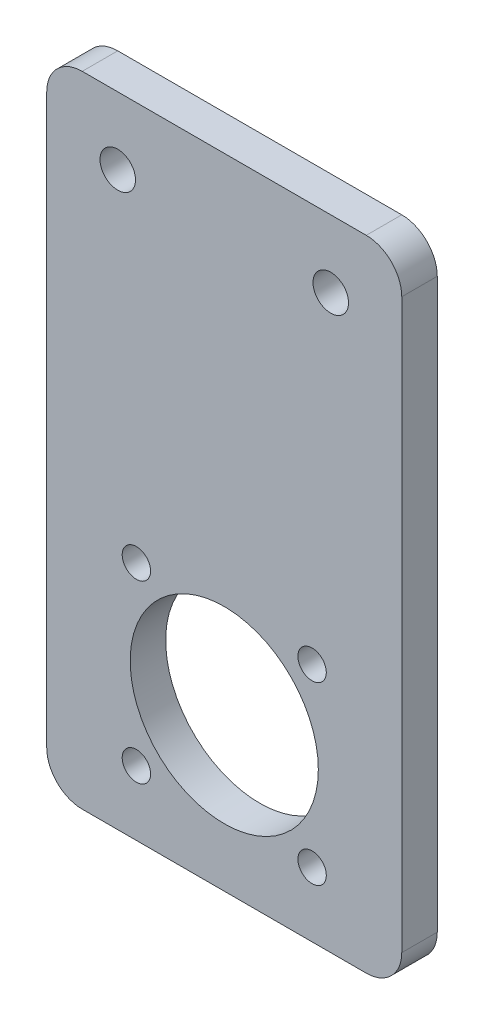
ISO-10303-21;
HEADER;
FILE_DESCRIPTION(('STEP AP214'),'2;1');
FILE_NAME('part.step','',(''),(''),'','','');
FILE_SCHEMA(('AUTOMOTIVE_DESIGN { 1 0 10303 214 1 1 1 1 }'));
ENDSEC;
DATA;
#1=APPLICATION_CONTEXT('core data for automotive mechanical design processes');
#2=APPLICATION_PROTOCOL_DEFINITION('international standard','automotive_design',2000,#1);
#3=PRODUCT_CONTEXT('',#1,'mechanical');
#4=PRODUCT('Part','Part','',(#3));
#5=PRODUCT_RELATED_PRODUCT_CATEGORY('part','',(#4));
#6=PRODUCT_DEFINITION_FORMATION('','',#4);
#7=PRODUCT_DEFINITION_CONTEXT('part definition',#1,'design');
#8=PRODUCT_DEFINITION('design','',#6,#7);
#9=PRODUCT_DEFINITION_SHAPE('','',#8);
#10=(LENGTH_UNIT() NAMED_UNIT(*) SI_UNIT(.MILLI.,.METRE.));
#11=(NAMED_UNIT(*) PLANE_ANGLE_UNIT() SI_UNIT($,.RADIAN.));
#12=(NAMED_UNIT(*) SI_UNIT($,.STERADIAN.) SOLID_ANGLE_UNIT());
#13=UNCERTAINTY_MEASURE_WITH_UNIT(LENGTH_MEASURE(1.E-05),#10,'distance_accuracy_value','');
#14=(GEOMETRIC_REPRESENTATION_CONTEXT(3) GLOBAL_UNCERTAINTY_ASSIGNED_CONTEXT((#13)) GLOBAL_UNIT_ASSIGNED_CONTEXT((#10,
#11,#12)) REPRESENTATION_CONTEXT('',''));
#15=CARTESIAN_POINT('',(0.,0.,0.));
#16=DIRECTION('',(0.,0.,1.));
#17=DIRECTION('',(1.,0.,0.));
#18=AXIS2_PLACEMENT_3D('',#15,#16,#17);
#19=CARTESIAN_POINT('',(0.,0.,5.));
#20=DIRECTION('',(0.,0.,1.));
#21=DIRECTION('',(1.,0.,0.));
#22=AXIS2_PLACEMENT_3D('',#19,#20,#21);
#23=PLANE('',#22);
#24=CARTESIAN_POINT('',(12.6256313292355,-80.8993686707646,5.));
#25=DIRECTION('',(0.,0.,1.));
#26=DIRECTION('',(1.,0.,0.));
#27=AXIS2_PLACEMENT_3D('',#24,#25,#26);
#28=CIRCLE('',#27,2.00000000000001);
#29=CARTESIAN_POINT('',(14.6256313292355,-80.8993686707646,5.));
#30=VERTEX_POINT('',#29);
#31=EDGE_CURVE('E249',#30,#30,#28,.T.);
#32=ORIENTED_EDGE('',*,*,#31,.F.);
#33=EDGE_LOOP('',(#32));
#34=FACE_BOUND('',#33,.T.);
#35=CARTESIAN_POINT('',(25.,-68.525,5.));
#36=DIRECTION('',(0.,0.,1.));
#37=DIRECTION('',(1.,0.,0.));
#38=AXIS2_PLACEMENT_3D('',#35,#36,#37);
#39=CIRCLE('',#38,13.25);
#40=CARTESIAN_POINT('',(38.25,-68.525,5.));
#41=VERTEX_POINT('',#40);
#42=EDGE_CURVE('E233',#41,#41,#39,.T.);
#43=ORIENTED_EDGE('',*,*,#42,.F.);
#44=EDGE_LOOP('',(#43));
#45=FACE_BOUND('',#44,.T.);
#46=CARTESIAN_POINT('',(40.,-9.5,5.));
#47=DIRECTION('',(0.,0.,1.));
#48=DIRECTION('',(1.,0.,0.));
#49=AXIS2_PLACEMENT_3D('',#46,#47,#48);
#50=CIRCLE('',#49,2.5);
#51=CARTESIAN_POINT('',(42.5,-9.5,5.));
#52=VERTEX_POINT('',#51);
#53=EDGE_CURVE('E219',#52,#52,#50,.T.);
#54=ORIENTED_EDGE('',*,*,#53,.F.);
#55=EDGE_LOOP('',(#54));
#56=FACE_BOUND('',#55,.T.);
#57=DIRECTION('',(1.,0.,0.));
#58=VECTOR('',#57,1.);
#59=CARTESIAN_POINT('',(0.,-90.,5.));
#60=LINE('',#59,#58);
#61=CARTESIAN_POINT('',(5.00000000000001,-90.,5.));
#62=VERTEX_POINT('',#61);
#63=CARTESIAN_POINT('',(45.,-90.,5.));
#64=VERTEX_POINT('',#63);
#65=EDGE_CURVE('E199',#62,#64,#60,.T.);
#66=ORIENTED_EDGE('',*,*,#65,.T.);
#67=CARTESIAN_POINT('',(45.,-85.,5.));
#68=DIRECTION('',(0.,0.,1.));
#69=DIRECTION('',(1.,0.,0.));
#70=AXIS2_PLACEMENT_3D('',#67,#68,#69);
#71=CIRCLE('',#70,5.);
#72=CARTESIAN_POINT('',(50.,-85.,5.));
#73=VERTEX_POINT('',#72);
#74=EDGE_CURVE('E172',#64,#73,#71,.T.);
#75=ORIENTED_EDGE('',*,*,#74,.T.);
#76=DIRECTION('',(0.,1.,0.));
#77=VECTOR('',#76,1.);
#78=CARTESIAN_POINT('',(50.,0.,5.));
#79=LINE('',#78,#77);
#80=CARTESIAN_POINT('',(50.,-5.,5.));
#81=VERTEX_POINT('',#80);
#82=EDGE_CURVE('E129',#73,#81,#79,.T.);
#83=ORIENTED_EDGE('',*,*,#82,.T.);
#84=CARTESIAN_POINT('',(45.,-5.,5.));
#85=DIRECTION('',(0.,0.,1.));
#86=DIRECTION('',(1.,0.,0.));
#87=AXIS2_PLACEMENT_3D('',#84,#85,#86);
#88=CIRCLE('',#87,5.);
#89=CARTESIAN_POINT('',(45.,0.,5.));
#90=VERTEX_POINT('',#89);
#91=EDGE_CURVE('E64',#81,#90,#88,.T.);
#92=ORIENTED_EDGE('',*,*,#91,.T.);
#93=DIRECTION('',(-1.,0.,0.));
#94=VECTOR('',#93,1.);
#95=CARTESIAN_POINT('',(0.,0.,5.));
#96=LINE('',#95,#94);
#97=CARTESIAN_POINT('',(5.,0.,5.));
#98=VERTEX_POINT('',#97);
#99=EDGE_CURVE('E150',#90,#98,#96,.T.);
#100=ORIENTED_EDGE('',*,*,#99,.T.);
#101=CARTESIAN_POINT('',(5.,-5.,5.));
#102=DIRECTION('',(0.,0.,1.));
#103=DIRECTION('',(1.,0.,0.));
#104=AXIS2_PLACEMENT_3D('',#101,#102,#103);
#105=CIRCLE('',#104,5.);
#106=CARTESIAN_POINT('',(0.,-5.,5.));
#107=VERTEX_POINT('',#106);
#108=EDGE_CURVE('E166',#98,#107,#105,.T.);
#109=ORIENTED_EDGE('',*,*,#108,.T.);
#110=DIRECTION('',(0.,-1.,0.));
#111=VECTOR('',#110,1.);
#112=CARTESIAN_POINT('',(0.,0.,5.));
#113=LINE('',#112,#111);
#114=CARTESIAN_POINT('',(0.,-85.,5.));
#115=VERTEX_POINT('',#114);
#116=EDGE_CURVE('E143',#107,#115,#113,.T.);
#117=ORIENTED_EDGE('',*,*,#116,.T.);
#118=CARTESIAN_POINT('',(5.00000000000001,-85.,5.));
#119=DIRECTION('',(0.,0.,1.));
#120=DIRECTION('',(1.,0.,0.));
#121=AXIS2_PLACEMENT_3D('',#118,#119,#120);
#122=CIRCLE('',#121,5.);
#123=EDGE_CURVE('E169',#115,#62,#122,.T.);
#124=ORIENTED_EDGE('',*,*,#123,.T.);
#125=EDGE_LOOP('',(#66,#75,#83,#92,#100,#109,#117,#124));
#126=FACE_BOUND('',#125,.T.);
#127=CARTESIAN_POINT('',(10.,-9.5,5.));
#128=DIRECTION('',(0.,0.,1.));
#129=DIRECTION('',(1.,0.,0.));
#130=AXIS2_PLACEMENT_3D('',#127,#128,#129);
#131=CIRCLE('',#130,2.5);
#132=CARTESIAN_POINT('',(12.5,-9.5,5.));
#133=VERTEX_POINT('',#132);
#134=EDGE_CURVE('E212',#133,#133,#131,.T.);
#135=ORIENTED_EDGE('',*,*,#134,.F.);
#136=EDGE_LOOP('',(#135));
#137=FACE_BOUND('',#136,.T.);
#138=CARTESIAN_POINT('',(37.3743686707646,-56.1506313292354,5.));
#139=DIRECTION('',(0.,0.,1.));
#140=DIRECTION('',(1.,0.,0.));
#141=AXIS2_PLACEMENT_3D('',#138,#139,#140);
#142=CIRCLE('',#141,2.00000000000001);
#143=CARTESIAN_POINT('',(39.3743686707646,-56.1506313292354,5.));
#144=VERTEX_POINT('',#143);
#145=EDGE_CURVE('E225',#144,#144,#142,.T.);
#146=ORIENTED_EDGE('',*,*,#145,.F.);
#147=EDGE_LOOP('',(#146));
#148=FACE_BOUND('',#147,.T.);
#149=CARTESIAN_POINT('',(37.3743686707646,-80.8993686707646,5.));
#150=DIRECTION('',(0.,0.,1.));
#151=DIRECTION('',(1.,0.,0.));
#152=AXIS2_PLACEMENT_3D('',#149,#150,#151);
#153=CIRCLE('',#152,2.);
#154=CARTESIAN_POINT('',(39.3743686707646,-80.8993686707646,5.));
#155=VERTEX_POINT('',#154);
#156=EDGE_CURVE('E241',#155,#155,#153,.T.);
#157=ORIENTED_EDGE('',*,*,#156,.F.);
#158=EDGE_LOOP('',(#157));
#159=FACE_BOUND('',#158,.T.);
#160=CARTESIAN_POINT('',(12.6256313292354,-56.1506313292354,5.));
#161=DIRECTION('',(0.,0.,1.));
#162=DIRECTION('',(1.,0.,0.));
#163=AXIS2_PLACEMENT_3D('',#160,#161,#162);
#164=CIRCLE('',#163,2.);
#165=CARTESIAN_POINT('',(14.6256313292354,-56.1506313292354,5.));
#166=VERTEX_POINT('',#165);
#167=EDGE_CURVE('E257',#166,#166,#164,.T.);
#168=ORIENTED_EDGE('',*,*,#167,.F.);
#169=EDGE_LOOP('',(#168));
#170=FACE_BOUND('',#169,.T.);
#171=ADVANCED_FACE('F43',(#34,#45,#56,#126,#137,#148,#159,#170),#23,.T.);
#172=CARTESIAN_POINT('',(0.,0.,0.));
#173=DIRECTION('',(0.,0.,1.));
#174=DIRECTION('',(1.,0.,0.));
#175=AXIS2_PLACEMENT_3D('',#172,#173,#174);
#176=PLANE('',#175);
#177=DIRECTION('',(0.,1.,0.));
#178=VECTOR('',#177,1.);
#179=CARTESIAN_POINT('',(50.,0.,0.));
#180=LINE('',#179,#178);
#181=CARTESIAN_POINT('',(50.,-85.,0.));
#182=VERTEX_POINT('',#181);
#183=CARTESIAN_POINT('',(50.,-5.,0.));
#184=VERTEX_POINT('',#183);
#185=EDGE_CURVE('E127',#182,#184,#180,.T.);
#186=ORIENTED_EDGE('',*,*,#185,.F.);
#187=CARTESIAN_POINT('',(45.,-85.,0.));
#188=DIRECTION('',(0.,0.,1.));
#189=DIRECTION('',(1.,0.,0.));
#190=AXIS2_PLACEMENT_3D('',#187,#188,#189);
#191=CIRCLE('',#190,5.);
#192=CARTESIAN_POINT('',(45.,-90.,0.));
#193=VERTEX_POINT('',#192);
#194=EDGE_CURVE('E109',#182,#193,#191,.F.);
#195=ORIENTED_EDGE('',*,*,#194,.T.);
#196=DIRECTION('',(1.,0.,0.));
#197=VECTOR('',#196,1.);
#198=CARTESIAN_POINT('',(0.,-90.,0.));
#199=LINE('',#198,#197);
#200=CARTESIAN_POINT('',(5.00000000000001,-90.,0.));
#201=VERTEX_POINT('',#200);
#202=EDGE_CURVE('E139',#201,#193,#199,.T.);
#203=ORIENTED_EDGE('',*,*,#202,.F.);
#204=CARTESIAN_POINT('',(5.00000000000001,-85.,0.));
#205=DIRECTION('',(0.,0.,1.));
#206=DIRECTION('',(1.,0.,0.));
#207=AXIS2_PLACEMENT_3D('',#204,#205,#206);
#208=CIRCLE('',#207,5.);
#209=CARTESIAN_POINT('',(0.,-85.,0.));
#210=VERTEX_POINT('',#209);
#211=EDGE_CURVE('E121',#201,#210,#208,.F.);
#212=ORIENTED_EDGE('',*,*,#211,.T.);
#213=DIRECTION('',(0.,-1.,0.));
#214=VECTOR('',#213,1.);
#215=CARTESIAN_POINT('',(0.,0.,0.));
#216=LINE('',#215,#214);
#217=CARTESIAN_POINT('',(0.,-5.,0.));
#218=VERTEX_POINT('',#217);
#219=EDGE_CURVE('E145',#218,#210,#216,.T.);
#220=ORIENTED_EDGE('',*,*,#219,.F.);
#221=CARTESIAN_POINT('',(5.,-5.,0.));
#222=DIRECTION('',(0.,0.,1.));
#223=DIRECTION('',(1.,0.,0.));
#224=AXIS2_PLACEMENT_3D('',#221,#222,#223);
#225=CIRCLE('',#224,5.);
#226=CARTESIAN_POINT('',(5.,0.,0.));
#227=VERTEX_POINT('',#226);
#228=EDGE_CURVE('E154',#218,#227,#225,.F.);
#229=ORIENTED_EDGE('',*,*,#228,.T.);
#230=DIRECTION('',(-1.,0.,0.));
#231=VECTOR('',#230,1.);
#232=CARTESIAN_POINT('',(0.,0.,0.));
#233=LINE('',#232,#231);
#234=CARTESIAN_POINT('',(45.,0.,0.));
#235=VERTEX_POINT('',#234);
#236=EDGE_CURVE('E138',#235,#227,#233,.T.);
#237=ORIENTED_EDGE('',*,*,#236,.F.);
#238=CARTESIAN_POINT('',(45.,-5.,0.));
#239=DIRECTION('',(0.,0.,1.));
#240=DIRECTION('',(1.,0.,0.));
#241=AXIS2_PLACEMENT_3D('',#238,#239,#240);
#242=CIRCLE('',#241,5.);
#243=EDGE_CURVE('E131',#235,#184,#242,.F.);
#244=ORIENTED_EDGE('',*,*,#243,.T.);
#245=EDGE_LOOP('',(#186,#195,#203,#212,#220,#229,#237,#244));
#246=FACE_BOUND('',#245,.T.);
#247=CARTESIAN_POINT('',(10.,-9.5,0.));
#248=DIRECTION('',(0.,0.,1.));
#249=DIRECTION('',(1.,0.,0.));
#250=AXIS2_PLACEMENT_3D('',#247,#248,#249);
#251=CIRCLE('',#250,2.5);
#252=CARTESIAN_POINT('',(12.5,-9.5,0.));
#253=VERTEX_POINT('',#252);
#254=EDGE_CURVE('E205',#253,#253,#251,.T.);
#255=ORIENTED_EDGE('',*,*,#254,.T.);
#256=EDGE_LOOP('',(#255));
#257=FACE_BOUND('',#256,.T.);
#258=CARTESIAN_POINT('',(40.,-9.5,0.));
#259=DIRECTION('',(0.,0.,1.));
#260=DIRECTION('',(1.,0.,0.));
#261=AXIS2_PLACEMENT_3D('',#258,#259,#260);
#262=CIRCLE('',#261,2.5);
#263=CARTESIAN_POINT('',(42.5,-9.5,0.));
#264=VERTEX_POINT('',#263);
#265=EDGE_CURVE('E221',#264,#264,#262,.T.);
#266=ORIENTED_EDGE('',*,*,#265,.T.);
#267=EDGE_LOOP('',(#266));
#268=FACE_BOUND('',#267,.T.);
#269=CARTESIAN_POINT('',(37.3743686707646,-56.1506313292354,0.));
#270=DIRECTION('',(0.,0.,1.));
#271=DIRECTION('',(1.,0.,0.));
#272=AXIS2_PLACEMENT_3D('',#269,#270,#271);
#273=CIRCLE('',#272,2.00000000000001);
#274=CARTESIAN_POINT('',(39.3743686707646,-56.1506313292354,0.));
#275=VERTEX_POINT('',#274);
#276=EDGE_CURVE('E229',#275,#275,#273,.T.);
#277=ORIENTED_EDGE('',*,*,#276,.T.);
#278=EDGE_LOOP('',(#277));
#279=FACE_BOUND('',#278,.T.);
#280=CARTESIAN_POINT('',(25.,-68.525,0.));
#281=DIRECTION('',(0.,0.,1.));
#282=DIRECTION('',(1.,0.,0.));
#283=AXIS2_PLACEMENT_3D('',#280,#281,#282);
#284=CIRCLE('',#283,13.25);
#285=CARTESIAN_POINT('',(38.25,-68.525,0.));
#286=VERTEX_POINT('',#285);
#287=EDGE_CURVE('E237',#286,#286,#284,.T.);
#288=ORIENTED_EDGE('',*,*,#287,.T.);
#289=EDGE_LOOP('',(#288));
#290=FACE_BOUND('',#289,.T.);
#291=CARTESIAN_POINT('',(37.3743686707646,-80.8993686707646,0.));
#292=DIRECTION('',(0.,0.,1.));
#293=DIRECTION('',(1.,0.,0.));
#294=AXIS2_PLACEMENT_3D('',#291,#292,#293);
#295=CIRCLE('',#294,2.);
#296=CARTESIAN_POINT('',(39.3743686707646,-80.8993686707646,0.));
#297=VERTEX_POINT('',#296);
#298=EDGE_CURVE('E245',#297,#297,#295,.T.);
#299=ORIENTED_EDGE('',*,*,#298,.T.);
#300=EDGE_LOOP('',(#299));
#301=FACE_BOUND('',#300,.T.);
#302=CARTESIAN_POINT('',(12.6256313292355,-80.8993686707646,0.));
#303=DIRECTION('',(0.,0.,1.));
#304=DIRECTION('',(1.,0.,0.));
#305=AXIS2_PLACEMENT_3D('',#302,#303,#304);
#306=CIRCLE('',#305,2.00000000000001);
#307=CARTESIAN_POINT('',(14.6256313292355,-80.8993686707646,0.));
#308=VERTEX_POINT('',#307);
#309=EDGE_CURVE('E253',#308,#308,#306,.T.);
#310=ORIENTED_EDGE('',*,*,#309,.T.);
#311=EDGE_LOOP('',(#310));
#312=FACE_BOUND('',#311,.T.);
#313=CARTESIAN_POINT('',(12.6256313292354,-56.1506313292354,0.));
#314=DIRECTION('',(0.,0.,1.));
#315=DIRECTION('',(1.,0.,0.));
#316=AXIS2_PLACEMENT_3D('',#313,#314,#315);
#317=CIRCLE('',#316,2.);
#318=CARTESIAN_POINT('',(14.6256313292354,-56.1506313292354,0.));
#319=VERTEX_POINT('',#318);
#320=EDGE_CURVE('E261',#319,#319,#317,.T.);
#321=ORIENTED_EDGE('',*,*,#320,.T.);
#322=EDGE_LOOP('',(#321));
#323=FACE_BOUND('',#322,.T.);
#324=ADVANCED_FACE('F134',(#246,#257,#268,#279,#290,#301,#312,#323),#176,.F.);
#325=CARTESIAN_POINT('',(0.,0.,5.));
#326=DIRECTION('',(1.,0.,0.));
#327=DIRECTION('',(0.,1.,0.));
#328=AXIS2_PLACEMENT_3D('',#325,#326,#327);
#329=PLANE('',#328);
#330=ORIENTED_EDGE('',*,*,#219,.T.);
#331=DIRECTION('',(0.,0.,-1.));
#332=VECTOR('',#331,1.);
#333=CARTESIAN_POINT('',(0.,-85.,5.));
#334=LINE('',#333,#332);
#335=EDGE_CURVE('E179',#210,#115,#334,.F.);
#336=ORIENTED_EDGE('',*,*,#335,.T.);
#337=ORIENTED_EDGE('',*,*,#116,.F.);
#338=DIRECTION('',(0.,0.,-1.));
#339=VECTOR('',#338,1.);
#340=CARTESIAN_POINT('',(0.,-5.,5.));
#341=LINE('',#340,#339);
#342=EDGE_CURVE('E175',#107,#218,#341,.T.);
#343=ORIENTED_EDGE('',*,*,#342,.T.);
#344=EDGE_LOOP('',(#330,#336,#337,#343));
#345=FACE_BOUND('',#344,.T.);
#346=ADVANCED_FACE('F194',(#345),#329,.F.);
#347=CARTESIAN_POINT('',(0.,-90.,5.));
#348=DIRECTION('',(0.,1.,0.));
#349=DIRECTION('',(0.,0.,1.));
#350=AXIS2_PLACEMENT_3D('',#347,#348,#349);
#351=PLANE('',#350);
#352=ORIENTED_EDGE('',*,*,#202,.T.);
#353=DIRECTION('',(0.,0.,-1.));
#354=VECTOR('',#353,1.);
#355=CARTESIAN_POINT('',(45.,-90.,5.));
#356=LINE('',#355,#354);
#357=EDGE_CURVE('E114',#193,#64,#356,.F.);
#358=ORIENTED_EDGE('',*,*,#357,.T.);
#359=ORIENTED_EDGE('',*,*,#65,.F.);
#360=DIRECTION('',(0.,0.,-1.));
#361=VECTOR('',#360,1.);
#362=CARTESIAN_POINT('',(5.00000000000001,-90.,5.));
#363=LINE('',#362,#361);
#364=EDGE_CURVE('E120',#62,#201,#363,.T.);
#365=ORIENTED_EDGE('',*,*,#364,.T.);
#366=EDGE_LOOP('',(#352,#358,#359,#365));
#367=FACE_BOUND('',#366,.T.);
#368=ADVANCED_FACE('F289',(#367),#351,.F.);
#369=CARTESIAN_POINT('',(50.,0.,5.));
#370=DIRECTION('',(-1.,0.,0.));
#371=DIRECTION('',(0.,-1.,0.));
#372=AXIS2_PLACEMENT_3D('',#369,#370,#371);
#373=PLANE('',#372);
#374=ORIENTED_EDGE('',*,*,#82,.F.);
#375=DIRECTION('',(0.,0.,-1.));
#376=VECTOR('',#375,1.);
#377=CARTESIAN_POINT('',(50.,-85.,5.));
#378=LINE('',#377,#376);
#379=EDGE_CURVE('E113',#73,#182,#378,.T.);
#380=ORIENTED_EDGE('',*,*,#379,.T.);
#381=ORIENTED_EDGE('',*,*,#185,.T.);
#382=DIRECTION('',(0.,0.,-1.));
#383=VECTOR('',#382,1.);
#384=CARTESIAN_POINT('',(50.,-5.,5.));
#385=LINE('',#384,#383);
#386=EDGE_CURVE('E132',#184,#81,#385,.F.);
#387=ORIENTED_EDGE('',*,*,#386,.T.);
#388=EDGE_LOOP('',(#374,#380,#381,#387));
#389=FACE_BOUND('',#388,.T.);
#390=ADVANCED_FACE('F126',(#389),#373,.F.);
#391=CARTESIAN_POINT('',(0.,0.,5.));
#392=DIRECTION('',(0.,-1.,0.));
#393=DIRECTION('',(0.,0.,-1.));
#394=AXIS2_PLACEMENT_3D('',#391,#392,#393);
#395=PLANE('',#394);
#396=ORIENTED_EDGE('',*,*,#236,.T.);
#397=DIRECTION('',(0.,0.,-1.));
#398=VECTOR('',#397,1.);
#399=CARTESIAN_POINT('',(5.,0.,5.));
#400=LINE('',#399,#398);
#401=EDGE_CURVE('E11',#227,#98,#400,.F.);
#402=ORIENTED_EDGE('',*,*,#401,.T.);
#403=ORIENTED_EDGE('',*,*,#99,.F.);
#404=DIRECTION('',(0.,0.,-1.));
#405=VECTOR('',#404,1.);
#406=CARTESIAN_POINT('',(45.,0.,5.));
#407=LINE('',#406,#405);
#408=EDGE_CURVE('E52',#90,#235,#407,.T.);
#409=ORIENTED_EDGE('',*,*,#408,.T.);
#410=EDGE_LOOP('',(#396,#402,#403,#409));
#411=FACE_BOUND('',#410,.T.);
#412=ADVANCED_FACE('F184',(#411),#395,.F.);
#413=CARTESIAN_POINT('',(10.,-9.5,5.));
#414=DIRECTION('',(0.,0.,-1.));
#415=DIRECTION('',(-1.,0.,0.));
#416=AXIS2_PLACEMENT_3D('',#413,#414,#415);
#417=CYLINDRICAL_SURFACE('',#416,2.5);
#418=ORIENTED_EDGE('',*,*,#134,.T.);
#419=EDGE_LOOP('',(#418));
#420=FACE_BOUND('',#419,.T.);
#421=ORIENTED_EDGE('',*,*,#254,.F.);
#422=EDGE_LOOP('',(#421));
#423=FACE_BOUND('',#422,.T.);
#424=ADVANCED_FACE('F282',(#420,#423),#417,.F.);
#425=CARTESIAN_POINT('',(40.,-9.5,5.));
#426=DIRECTION('',(0.,0.,-1.));
#427=DIRECTION('',(-1.,0.,0.));
#428=AXIS2_PLACEMENT_3D('',#425,#426,#427);
#429=CYLINDRICAL_SURFACE('',#428,2.5);
#430=ORIENTED_EDGE('',*,*,#53,.T.);
#431=EDGE_LOOP('',(#430));
#432=FACE_BOUND('',#431,.T.);
#433=ORIENTED_EDGE('',*,*,#265,.F.);
#434=EDGE_LOOP('',(#433));
#435=FACE_BOUND('',#434,.T.);
#436=ADVANCED_FACE('F339',(#432,#435),#429,.F.);
#437=CARTESIAN_POINT('',(37.3743686707646,-56.1506313292354,5.));
#438=DIRECTION('',(0.,0.,-1.));
#439=DIRECTION('',(-1.,0.,0.));
#440=AXIS2_PLACEMENT_3D('',#437,#438,#439);
#441=CYLINDRICAL_SURFACE('',#440,2.00000000000001);
#442=ORIENTED_EDGE('',*,*,#145,.T.);
#443=EDGE_LOOP('',(#442));
#444=FACE_BOUND('',#443,.T.);
#445=ORIENTED_EDGE('',*,*,#276,.F.);
#446=EDGE_LOOP('',(#445));
#447=FACE_BOUND('',#446,.T.);
#448=ADVANCED_FACE('F336',(#444,#447),#441,.F.);
#449=CARTESIAN_POINT('',(25.,-68.525,5.));
#450=DIRECTION('',(0.,0.,-1.));
#451=DIRECTION('',(-1.,0.,0.));
#452=AXIS2_PLACEMENT_3D('',#449,#450,#451);
#453=CYLINDRICAL_SURFACE('',#452,13.25);
#454=ORIENTED_EDGE('',*,*,#42,.T.);
#455=EDGE_LOOP('',(#454));
#456=FACE_BOUND('',#455,.T.);
#457=ORIENTED_EDGE('',*,*,#287,.F.);
#458=EDGE_LOOP('',(#457));
#459=FACE_BOUND('',#458,.T.);
#460=ADVANCED_FACE('F318',(#456,#459),#453,.F.);
#461=CARTESIAN_POINT('',(37.3743686707646,-80.8993686707646,5.));
#462=DIRECTION('',(0.,0.,-1.));
#463=DIRECTION('',(-1.,0.,0.));
#464=AXIS2_PLACEMENT_3D('',#461,#462,#463);
#465=CYLINDRICAL_SURFACE('',#464,2.);
#466=ORIENTED_EDGE('',*,*,#156,.T.);
#467=EDGE_LOOP('',(#466));
#468=FACE_BOUND('',#467,.T.);
#469=ORIENTED_EDGE('',*,*,#298,.F.);
#470=EDGE_LOOP('',(#469));
#471=FACE_BOUND('',#470,.T.);
#472=ADVANCED_FACE('F314',(#468,#471),#465,.F.);
#473=CARTESIAN_POINT('',(12.6256313292355,-80.8993686707646,5.));
#474=DIRECTION('',(0.,0.,-1.));
#475=DIRECTION('',(-1.,0.,0.));
#476=AXIS2_PLACEMENT_3D('',#473,#474,#475);
#477=CYLINDRICAL_SURFACE('',#476,2.00000000000001);
#478=ORIENTED_EDGE('',*,*,#31,.T.);
#479=EDGE_LOOP('',(#478));
#480=FACE_BOUND('',#479,.T.);
#481=ORIENTED_EDGE('',*,*,#309,.F.);
#482=EDGE_LOOP('',(#481));
#483=FACE_BOUND('',#482,.T.);
#484=ADVANCED_FACE('F317',(#480,#483),#477,.F.);
#485=CARTESIAN_POINT('',(12.6256313292354,-56.1506313292354,5.));
#486=DIRECTION('',(0.,0.,-1.));
#487=DIRECTION('',(-1.,0.,0.));
#488=AXIS2_PLACEMENT_3D('',#485,#486,#487);
#489=CYLINDRICAL_SURFACE('',#488,2.);
#490=ORIENTED_EDGE('',*,*,#167,.T.);
#491=EDGE_LOOP('',(#490));
#492=FACE_BOUND('',#491,.T.);
#493=ORIENTED_EDGE('',*,*,#320,.F.);
#494=EDGE_LOOP('',(#493));
#495=FACE_BOUND('',#494,.T.);
#496=ADVANCED_FACE('F269',(#492,#495),#489,.F.);
#497=CARTESIAN_POINT('',(45.,-85.,5.));
#498=DIRECTION('',(0.,0.,-1.));
#499=DIRECTION('',(-1.,0.,0.));
#500=AXIS2_PLACEMENT_3D('',#497,#498,#499);
#501=CYLINDRICAL_SURFACE('',#500,5.);
#502=ORIENTED_EDGE('',*,*,#74,.F.);
#503=ORIENTED_EDGE('',*,*,#357,.F.);
#504=ORIENTED_EDGE('',*,*,#194,.F.);
#505=ORIENTED_EDGE('',*,*,#379,.F.);
#506=EDGE_LOOP('',(#502,#503,#504,#505));
#507=FACE_BOUND('',#506,.T.);
#508=ADVANCED_FACE('F112',(#507),#501,.T.);
#509=CARTESIAN_POINT('',(5.00000000000001,-85.,5.));
#510=DIRECTION('',(0.,0.,-1.));
#511=DIRECTION('',(-1.,0.,0.));
#512=AXIS2_PLACEMENT_3D('',#509,#510,#511);
#513=CYLINDRICAL_SURFACE('',#512,5.);
#514=ORIENTED_EDGE('',*,*,#123,.F.);
#515=ORIENTED_EDGE('',*,*,#335,.F.);
#516=ORIENTED_EDGE('',*,*,#211,.F.);
#517=ORIENTED_EDGE('',*,*,#364,.F.);
#518=EDGE_LOOP('',(#514,#515,#516,#517));
#519=FACE_BOUND('',#518,.T.);
#520=ADVANCED_FACE('F297',(#519),#513,.T.);
#521=CARTESIAN_POINT('',(5.,-5.,5.));
#522=DIRECTION('',(0.,0.,-1.));
#523=DIRECTION('',(-1.,0.,0.));
#524=AXIS2_PLACEMENT_3D('',#521,#522,#523);
#525=CYLINDRICAL_SURFACE('',#524,5.);
#526=ORIENTED_EDGE('',*,*,#108,.F.);
#527=ORIENTED_EDGE('',*,*,#401,.F.);
#528=ORIENTED_EDGE('',*,*,#228,.F.);
#529=ORIENTED_EDGE('',*,*,#342,.F.);
#530=EDGE_LOOP('',(#526,#527,#528,#529));
#531=FACE_BOUND('',#530,.T.);
#532=ADVANCED_FACE('F191',(#531),#525,.T.);
#533=CARTESIAN_POINT('',(45.,-5.,5.));
#534=DIRECTION('',(0.,0.,-1.));
#535=DIRECTION('',(-1.,0.,0.));
#536=AXIS2_PLACEMENT_3D('',#533,#534,#535);
#537=CYLINDRICAL_SURFACE('',#536,5.);
#538=ORIENTED_EDGE('',*,*,#91,.F.);
#539=ORIENTED_EDGE('',*,*,#386,.F.);
#540=ORIENTED_EDGE('',*,*,#243,.F.);
#541=ORIENTED_EDGE('',*,*,#408,.F.);
#542=EDGE_LOOP('',(#538,#539,#540,#541));
#543=FACE_BOUND('',#542,.T.);
#544=ADVANCED_FACE('F45',(#543),#537,.T.);
#545=CLOSED_SHELL('',(#171,#324,#346,#368,#390,#412,#424,#436,#448,#460,#472,#484,#496,#508,
#520,#532,#544));
#546=MANIFOLD_SOLID_BREP('B2',#545);
#547=ADVANCED_BREP_SHAPE_REPRESENTATION('',(#18,#546),#14);
#548=SHAPE_DEFINITION_REPRESENTATION(#9,#547);
ENDSEC;
END-ISO-10303-21;
